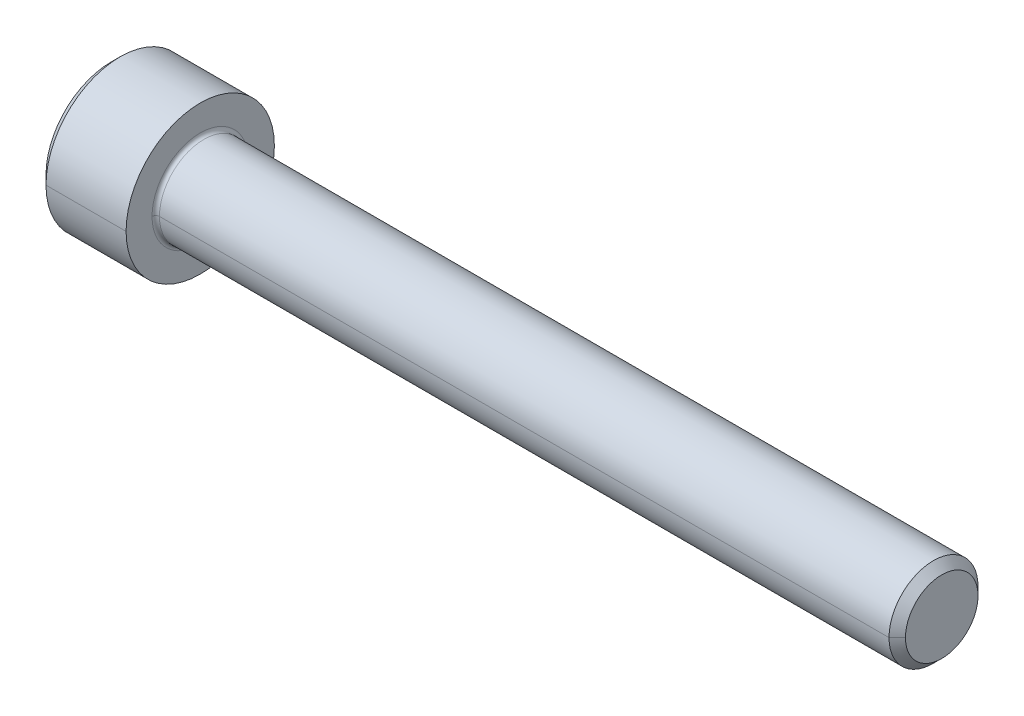
ISO-10303-21;
HEADER;
FILE_DESCRIPTION(('STEP AP214'),'2;1');
FILE_NAME('part.step','',(''),(''),'','','');
FILE_SCHEMA(('AUTOMOTIVE_DESIGN { 1 0 10303 214 1 1 1 1 }'));
ENDSEC;
DATA;
#1=APPLICATION_CONTEXT('core data for automotive mechanical design processes');
#2=APPLICATION_PROTOCOL_DEFINITION('international standard','automotive_design',2000,#1);
#3=PRODUCT_CONTEXT('',#1,'mechanical');
#4=PRODUCT('Part','Part','',(#3));
#5=PRODUCT_RELATED_PRODUCT_CATEGORY('part','',(#4));
#6=PRODUCT_DEFINITION_FORMATION('','',#4);
#7=PRODUCT_DEFINITION_CONTEXT('part definition',#1,'design');
#8=PRODUCT_DEFINITION('design','',#6,#7);
#9=PRODUCT_DEFINITION_SHAPE('','',#8);
#10=(LENGTH_UNIT() NAMED_UNIT(*) SI_UNIT(.MILLI.,.METRE.));
#11=(NAMED_UNIT(*) PLANE_ANGLE_UNIT() SI_UNIT($,.RADIAN.));
#12=(NAMED_UNIT(*) SI_UNIT($,.STERADIAN.) SOLID_ANGLE_UNIT());
#13=UNCERTAINTY_MEASURE_WITH_UNIT(LENGTH_MEASURE(1.E-05),#10,'distance_accuracy_value','');
#14=(GEOMETRIC_REPRESENTATION_CONTEXT(3) GLOBAL_UNCERTAINTY_ASSIGNED_CONTEXT((#13)) GLOBAL_UNIT_ASSIGNED_CONTEXT((#10,
#11,#12)) REPRESENTATION_CONTEXT('',''));
#15=CARTESIAN_POINT('',(0.,0.,0.));
#16=DIRECTION('',(0.,0.,1.));
#17=DIRECTION('',(1.,0.,0.));
#18=AXIS2_PLACEMENT_3D('',#15,#16,#17);
#19=CARTESIAN_POINT('',(3.,0.,0.));
#20=DIRECTION('',(-1.,0.,0.));
#21=DIRECTION('',(0.,0.,1.));
#22=AXIS2_PLACEMENT_3D('',#19,#20,#21);
#23=CONICAL_SURFACE('',#22,2.542,1.0471975511966);
#24=DIRECTION('',(-0.5,0.,-0.866025403784437));
#25=VECTOR('',#24,1.);
#26=CARTESIAN_POINT('',(3.,0.,-2.542));
#27=LINE('',#26,#25);
#28=CARTESIAN_POINT('',(4.46762438428004,0.,0.));
#29=VERTEX_POINT('',#28);
#30=CARTESIAN_POINT('',(3.,0.,-2.542));
#31=VERTEX_POINT('',#30);
#32=EDGE_CURVE('E172',#29,#31,#27,.T.);
#33=ORIENTED_EDGE('',*,*,#32,.F.);
#34=DIRECTION('',(-0.5,0.,0.866025403784437));
#35=VECTOR('',#34,1.);
#36=CARTESIAN_POINT('',(3.,0.,2.542));
#37=LINE('',#36,#35);
#38=CARTESIAN_POINT('',(3.,0.,2.542));
#39=VERTEX_POINT('',#38);
#40=EDGE_CURVE('E175',#29,#39,#37,.T.);
#41=ORIENTED_EDGE('',*,*,#40,.T.);
#42=CARTESIAN_POINT('',(3.,0.,0.));
#43=DIRECTION('',(-1.,0.,0.));
#44=DIRECTION('',(0.,0.,1.));
#45=AXIS2_PLACEMENT_3D('',#42,#43,#44);
#46=CIRCLE('',#45,2.542);
#47=CARTESIAN_POINT('',(3.,2.20143657642004,1.271));
#48=VERTEX_POINT('',#47);
#49=EDGE_CURVE('E193',#39,#48,#46,.T.);
#50=ORIENTED_EDGE('',*,*,#49,.T.);
#51=CARTESIAN_POINT('',(3.,0.,0.));
#52=DIRECTION('',(-1.,0.,0.));
#53=DIRECTION('',(0.,0.,1.));
#54=AXIS2_PLACEMENT_3D('',#51,#52,#53);
#55=CIRCLE('',#54,2.542);
#56=CARTESIAN_POINT('',(3.,2.20143657642004,-1.271));
#57=VERTEX_POINT('',#56);
#58=EDGE_CURVE('E25',#48,#57,#55,.T.);
#59=ORIENTED_EDGE('',*,*,#58,.T.);
#60=CARTESIAN_POINT('',(3.,0.,0.));
#61=DIRECTION('',(-1.,0.,0.));
#62=DIRECTION('',(0.,0.,1.));
#63=AXIS2_PLACEMENT_3D('',#60,#61,#62);
#64=CIRCLE('',#63,2.542);
#65=EDGE_CURVE('E11',#57,#31,#64,.T.);
#66=ORIENTED_EDGE('',*,*,#65,.T.);
#67=EDGE_LOOP('',(#33,#41,#50,#59,#66));
#68=FACE_BOUND('',#67,.T.);
#69=ADVANCED_FACE('F16',(#68),#23,.F.);
#70=CARTESIAN_POINT('',(3.,4.40287315284008,-2.542));
#71=DIRECTION('',(1.,0.,0.));
#72=DIRECTION('',(0.,1.,0.));
#73=AXIS2_PLACEMENT_3D('',#70,#71,#72);
#74=PLANE('',#73);
#75=DIRECTION('',(0.,-0.5,-0.866025403784438));
#76=VECTOR('',#75,1.);
#77=CARTESIAN_POINT('',(3.,2.93524876856006,0.));
#78=LINE('',#77,#76);
#79=CARTESIAN_POINT('',(3.,1.46762438428002,-2.542));
#80=VERTEX_POINT('',#79);
#81=EDGE_CURVE('E43',#57,#80,#78,.T.);
#82=ORIENTED_EDGE('',*,*,#81,.T.);
#83=DIRECTION('',(0.,-1.,0.));
#84=VECTOR('',#83,1.);
#85=CARTESIAN_POINT('',(3.,1.46762438428002,-2.542));
#86=LINE('',#85,#84);
#87=EDGE_CURVE('E365',#80,#31,#86,.T.);
#88=ORIENTED_EDGE('',*,*,#87,.T.);
#89=ORIENTED_EDGE('',*,*,#65,.F.);
#90=EDGE_LOOP('',(#82,#88,#89));
#91=FACE_BOUND('',#90,.T.);
#92=ADVANCED_FACE('F392',(#91),#74,.F.);
#93=CARTESIAN_POINT('',(3.,4.40287315284008,-2.542));
#94=DIRECTION('',(1.,0.,0.));
#95=DIRECTION('',(0.,1.,0.));
#96=AXIS2_PLACEMENT_3D('',#93,#94,#95);
#97=PLANE('',#96);
#98=DIRECTION('',(0.,-0.5,0.866025403784439));
#99=VECTOR('',#98,1.);
#100=CARTESIAN_POINT('',(3.,2.93524876856006,0.));
#101=LINE('',#100,#99);
#102=CARTESIAN_POINT('',(3.,2.93524876856006,0.));
#103=VERTEX_POINT('',#102);
#104=EDGE_CURVE('E219',#103,#48,#101,.T.);
#105=ORIENTED_EDGE('',*,*,#104,.F.);
#106=DIRECTION('',(0.,-0.5,-0.866025403784438));
#107=VECTOR('',#106,1.);
#108=CARTESIAN_POINT('',(3.,2.93524876856006,0.));
#109=LINE('',#108,#107);
#110=EDGE_CURVE('E372',#103,#57,#109,.T.);
#111=ORIENTED_EDGE('',*,*,#110,.T.);
#112=ORIENTED_EDGE('',*,*,#58,.F.);
#113=EDGE_LOOP('',(#105,#111,#112));
#114=FACE_BOUND('',#113,.T.);
#115=ADVANCED_FACE('F18',(#114),#97,.F.);
#116=CARTESIAN_POINT('',(3.,4.40287315284008,-2.542));
#117=DIRECTION('',(1.,0.,0.));
#118=DIRECTION('',(0.,1.,0.));
#119=AXIS2_PLACEMENT_3D('',#116,#117,#118);
#120=PLANE('',#119);
#121=DIRECTION('',(0.,1.,0.));
#122=VECTOR('',#121,1.);
#123=CARTESIAN_POINT('',(3.,-1.46762438428003,2.542));
#124=LINE('',#123,#122);
#125=CARTESIAN_POINT('',(3.,1.46762438428003,2.542));
#126=VERTEX_POINT('',#125);
#127=EDGE_CURVE('E330',#39,#126,#124,.T.);
#128=ORIENTED_EDGE('',*,*,#127,.T.);
#129=DIRECTION('',(0.,-0.5,0.866025403784439));
#130=VECTOR('',#129,1.);
#131=CARTESIAN_POINT('',(3.,2.93524876856006,0.));
#132=LINE('',#131,#130);
#133=EDGE_CURVE('E223',#48,#126,#132,.T.);
#134=ORIENTED_EDGE('',*,*,#133,.F.);
#135=ORIENTED_EDGE('',*,*,#49,.F.);
#136=EDGE_LOOP('',(#128,#134,#135));
#137=FACE_BOUND('',#136,.T.);
#138=ADVANCED_FACE('F384',(#137),#120,.F.);
#139=CARTESIAN_POINT('',(3.,4.40287315284008,-2.542));
#140=DIRECTION('',(1.,0.,0.));
#141=DIRECTION('',(0.,1.,0.));
#142=AXIS2_PLACEMENT_3D('',#139,#140,#141);
#143=PLANE('',#142);
#144=DIRECTION('',(0.,-0.5,-0.866025403784438));
#145=VECTOR('',#144,1.);
#146=CARTESIAN_POINT('',(3.,-1.46762438428003,2.542));
#147=LINE('',#146,#145);
#148=CARTESIAN_POINT('',(3.,-1.46762438428003,2.542));
#149=VERTEX_POINT('',#148);
#150=CARTESIAN_POINT('',(3.,-2.20143657642005,1.271));
#151=VERTEX_POINT('',#150);
#152=EDGE_CURVE('E340',#149,#151,#147,.T.);
#153=ORIENTED_EDGE('',*,*,#152,.F.);
#154=DIRECTION('',(0.,1.,0.));
#155=VECTOR('',#154,1.);
#156=CARTESIAN_POINT('',(3.,-1.46762438428003,2.542));
#157=LINE('',#156,#155);
#158=EDGE_CURVE('E333',#149,#39,#157,.T.);
#159=ORIENTED_EDGE('',*,*,#158,.T.);
#160=CARTESIAN_POINT('',(3.,0.,0.));
#161=DIRECTION('',(-1.,0.,0.));
#162=DIRECTION('',(0.,0.,1.));
#163=AXIS2_PLACEMENT_3D('',#160,#161,#162);
#164=CIRCLE('',#163,2.542);
#165=EDGE_CURVE('E185',#151,#39,#164,.T.);
#166=ORIENTED_EDGE('',*,*,#165,.F.);
#167=EDGE_LOOP('',(#153,#159,#166));
#168=FACE_BOUND('',#167,.T.);
#169=ADVANCED_FACE('F399',(#168),#143,.F.);
#170=CARTESIAN_POINT('',(3.,4.40287315284008,-2.542));
#171=DIRECTION('',(1.,0.,0.));
#172=DIRECTION('',(0.,1.,0.));
#173=AXIS2_PLACEMENT_3D('',#170,#171,#172);
#174=PLANE('',#173);
#175=DIRECTION('',(0.,0.5,-0.866025403784439));
#176=VECTOR('',#175,1.);
#177=CARTESIAN_POINT('',(3.,-2.93524876856007,0.));
#178=LINE('',#177,#176);
#179=CARTESIAN_POINT('',(3.,-2.93524876856007,0.));
#180=VERTEX_POINT('',#179);
#181=CARTESIAN_POINT('',(3.,-2.20143657642005,-1.271));
#182=VERTEX_POINT('',#181);
#183=EDGE_CURVE('E351',#180,#182,#178,.T.);
#184=ORIENTED_EDGE('',*,*,#183,.F.);
#185=DIRECTION('',(0.,-0.5,-0.866025403784438));
#186=VECTOR('',#185,1.);
#187=CARTESIAN_POINT('',(3.,-1.46762438428003,2.542));
#188=LINE('',#187,#186);
#189=EDGE_CURVE('E344',#151,#180,#188,.T.);
#190=ORIENTED_EDGE('',*,*,#189,.F.);
#191=CARTESIAN_POINT('',(3.,0.,0.));
#192=DIRECTION('',(-1.,0.,0.));
#193=DIRECTION('',(0.,0.,1.));
#194=AXIS2_PLACEMENT_3D('',#191,#192,#193);
#195=CIRCLE('',#194,2.542);
#196=EDGE_CURVE('E201',#182,#151,#195,.T.);
#197=ORIENTED_EDGE('',*,*,#196,.F.);
#198=EDGE_LOOP('',(#184,#190,#197));
#199=FACE_BOUND('',#198,.T.);
#200=ADVANCED_FACE('F471',(#199),#174,.F.);
#201=CARTESIAN_POINT('',(3.,4.40287315284008,-2.542));
#202=DIRECTION('',(1.,0.,0.));
#203=DIRECTION('',(0.,1.,0.));
#204=AXIS2_PLACEMENT_3D('',#201,#202,#203);
#205=PLANE('',#204);
#206=DIRECTION('',(0.,-1.,0.));
#207=VECTOR('',#206,1.);
#208=CARTESIAN_POINT('',(3.,1.46762438428002,-2.542));
#209=LINE('',#208,#207);
#210=CARTESIAN_POINT('',(3.,-1.46762438428004,-2.542));
#211=VERTEX_POINT('',#210);
#212=EDGE_CURVE('E362',#31,#211,#209,.T.);
#213=ORIENTED_EDGE('',*,*,#212,.T.);
#214=DIRECTION('',(0.,0.5,-0.866025403784439));
#215=VECTOR('',#214,1.);
#216=CARTESIAN_POINT('',(3.,-2.93524876856007,0.));
#217=LINE('',#216,#215);
#218=EDGE_CURVE('E355',#182,#211,#217,.T.);
#219=ORIENTED_EDGE('',*,*,#218,.F.);
#220=CARTESIAN_POINT('',(3.,0.,0.));
#221=DIRECTION('',(-1.,0.,0.));
#222=DIRECTION('',(0.,0.,1.));
#223=AXIS2_PLACEMENT_3D('',#220,#221,#222);
#224=CIRCLE('',#223,2.542);
#225=EDGE_CURVE('E179',#31,#182,#224,.T.);
#226=ORIENTED_EDGE('',*,*,#225,.F.);
#227=EDGE_LOOP('',(#213,#219,#226));
#228=FACE_BOUND('',#227,.T.);
#229=ADVANCED_FACE('F467',(#228),#205,.F.);
#230=CARTESIAN_POINT('',(3.,2.93524876856006,0.));
#231=DIRECTION('',(0.,0.866025403784438,-0.5));
#232=DIRECTION('',(-1.,0.,0.));
#233=AXIS2_PLACEMENT_3D('',#230,#231,#232);
#234=PLANE('',#233);
#235=DIRECTION('',(0.,-0.5,-0.866025403784438));
#236=VECTOR('',#235,1.);
#237=CARTESIAN_POINT('',(0.,2.93524876856006,0.));
#238=LINE('',#237,#236);
#239=CARTESIAN_POINT('',(0.,2.93524876856006,0.));
#240=VERTEX_POINT('',#239);
#241=CARTESIAN_POINT('',(0.,1.46762438428002,-2.542));
#242=VERTEX_POINT('',#241);
#243=EDGE_CURVE('E301',#240,#242,#238,.T.);
#244=ORIENTED_EDGE('',*,*,#243,.T.);
#245=DIRECTION('',(-1.,0.,0.));
#246=VECTOR('',#245,1.);
#247=CARTESIAN_POINT('',(3.,1.46762438428002,-2.542));
#248=LINE('',#247,#246);
#249=EDGE_CURVE('E368',#80,#242,#248,.T.);
#250=ORIENTED_EDGE('',*,*,#249,.F.);
#251=ORIENTED_EDGE('',*,*,#81,.F.);
#252=ORIENTED_EDGE('',*,*,#110,.F.);
#253=DIRECTION('',(-1.,0.,0.));
#254=VECTOR('',#253,1.);
#255=CARTESIAN_POINT('',(3.,2.93524876856006,0.));
#256=LINE('',#255,#254);
#257=EDGE_CURVE('E224',#103,#240,#256,.T.);
#258=ORIENTED_EDGE('',*,*,#257,.T.);
#259=EDGE_LOOP('',(#244,#250,#251,#252,#258));
#260=FACE_BOUND('',#259,.T.);
#261=ADVANCED_FACE('F429',(#260),#234,.F.);
#262=CARTESIAN_POINT('',(3.,1.46762438428002,-2.542));
#263=DIRECTION('',(0.,0.,-1.));
#264=DIRECTION('',(0.,-1.,0.));
#265=AXIS2_PLACEMENT_3D('',#262,#263,#264);
#266=PLANE('',#265);
#267=DIRECTION('',(0.,-1.,0.));
#268=VECTOR('',#267,1.);
#269=CARTESIAN_POINT('',(0.,1.46762438428002,-2.542));
#270=LINE('',#269,#268);
#271=CARTESIAN_POINT('',(0.,-1.46762438428004,-2.542));
#272=VERTEX_POINT('',#271);
#273=EDGE_CURVE('E305',#242,#272,#270,.T.);
#274=ORIENTED_EDGE('',*,*,#273,.T.);
#275=DIRECTION('',(-1.,0.,0.));
#276=VECTOR('',#275,1.);
#277=CARTESIAN_POINT('',(3.,-1.46762438428004,-2.542));
#278=LINE('',#277,#276);
#279=EDGE_CURVE('E359',#211,#272,#278,.T.);
#280=ORIENTED_EDGE('',*,*,#279,.F.);
#281=ORIENTED_EDGE('',*,*,#212,.F.);
#282=ORIENTED_EDGE('',*,*,#87,.F.);
#283=ORIENTED_EDGE('',*,*,#249,.T.);
#284=EDGE_LOOP('',(#274,#280,#281,#282,#283));
#285=FACE_BOUND('',#284,.T.);
#286=ADVANCED_FACE('F425',(#285),#266,.F.);
#287=CARTESIAN_POINT('',(3.,-2.93524876856007,0.));
#288=DIRECTION('',(0.,0.866025403784439,0.5));
#289=DIRECTION('',(1.,0.,0.));
#290=AXIS2_PLACEMENT_3D('',#287,#288,#289);
#291=PLANE('',#290);
#292=DIRECTION('',(0.,0.5,-0.866025403784439));
#293=VECTOR('',#292,1.);
#294=CARTESIAN_POINT('',(0.,-2.93524876856007,0.));
#295=LINE('',#294,#293);
#296=CARTESIAN_POINT('',(0.,-2.93524876856007,0.));
#297=VERTEX_POINT('',#296);
#298=EDGE_CURVE('E300',#297,#272,#295,.T.);
#299=ORIENTED_EDGE('',*,*,#298,.F.);
#300=DIRECTION('',(-1.,0.,0.));
#301=VECTOR('',#300,1.);
#302=CARTESIAN_POINT('',(3.,-2.93524876856007,0.));
#303=LINE('',#302,#301);
#304=EDGE_CURVE('E348',#180,#297,#303,.T.);
#305=ORIENTED_EDGE('',*,*,#304,.F.);
#306=ORIENTED_EDGE('',*,*,#183,.T.);
#307=ORIENTED_EDGE('',*,*,#218,.T.);
#308=ORIENTED_EDGE('',*,*,#279,.T.);
#309=EDGE_LOOP('',(#299,#305,#306,#307,#308));
#310=FACE_BOUND('',#309,.T.);
#311=ADVANCED_FACE('F428',(#310),#291,.T.);
#312=CARTESIAN_POINT('',(3.,-1.46762438428003,2.542));
#313=DIRECTION('',(0.,0.866025403784438,-0.5));
#314=DIRECTION('',(-1.,0.,0.));
#315=AXIS2_PLACEMENT_3D('',#312,#313,#314);
#316=PLANE('',#315);
#317=DIRECTION('',(0.,-0.5,-0.866025403784438));
#318=VECTOR('',#317,1.);
#319=CARTESIAN_POINT('',(0.,-1.46762438428003,2.542));
#320=LINE('',#319,#318);
#321=CARTESIAN_POINT('',(0.,-1.46762438428003,2.542));
#322=VERTEX_POINT('',#321);
#323=EDGE_CURVE('E255',#322,#297,#320,.T.);
#324=ORIENTED_EDGE('',*,*,#323,.F.);
#325=DIRECTION('',(-1.,0.,0.));
#326=VECTOR('',#325,1.);
#327=CARTESIAN_POINT('',(3.,-1.46762438428003,2.542));
#328=LINE('',#327,#326);
#329=EDGE_CURVE('E337',#149,#322,#328,.T.);
#330=ORIENTED_EDGE('',*,*,#329,.F.);
#331=ORIENTED_EDGE('',*,*,#152,.T.);
#332=ORIENTED_EDGE('',*,*,#189,.T.);
#333=ORIENTED_EDGE('',*,*,#304,.T.);
#334=EDGE_LOOP('',(#324,#330,#331,#332,#333));
#335=FACE_BOUND('',#334,.T.);
#336=ADVANCED_FACE('F434',(#335),#316,.T.);
#337=CARTESIAN_POINT('',(3.,-1.46762438428003,2.542));
#338=DIRECTION('',(0.,0.,1.));
#339=DIRECTION('',(0.,-1.,0.));
#340=AXIS2_PLACEMENT_3D('',#337,#338,#339);
#341=PLANE('',#340);
#342=DIRECTION('',(0.,1.,0.));
#343=VECTOR('',#342,1.);
#344=CARTESIAN_POINT('',(0.,-1.46762438428003,2.542));
#345=LINE('',#344,#343);
#346=CARTESIAN_POINT('',(0.,1.46762438428003,2.542));
#347=VERTEX_POINT('',#346);
#348=EDGE_CURVE('E251',#322,#347,#345,.T.);
#349=ORIENTED_EDGE('',*,*,#348,.T.);
#350=DIRECTION('',(-1.,0.,0.));
#351=VECTOR('',#350,1.);
#352=CARTESIAN_POINT('',(3.,1.46762438428003,2.542));
#353=LINE('',#352,#351);
#354=EDGE_CURVE('E320',#126,#347,#353,.T.);
#355=ORIENTED_EDGE('',*,*,#354,.F.);
#356=ORIENTED_EDGE('',*,*,#127,.F.);
#357=ORIENTED_EDGE('',*,*,#158,.F.);
#358=ORIENTED_EDGE('',*,*,#329,.T.);
#359=EDGE_LOOP('',(#349,#355,#356,#357,#358));
#360=FACE_BOUND('',#359,.T.);
#361=ADVANCED_FACE('F431',(#360),#341,.F.);
#362=CARTESIAN_POINT('',(3.,2.93524876856006,0.));
#363=DIRECTION('',(0.,-0.866025403784439,-0.5));
#364=DIRECTION('',(0.,0.5,-0.866025403784439));
#365=AXIS2_PLACEMENT_3D('',#362,#363,#364);
#366=PLANE('',#365);
#367=DIRECTION('',(0.,-0.5,0.866025403784439));
#368=VECTOR('',#367,1.);
#369=CARTESIAN_POINT('',(0.,2.93524876856006,0.));
#370=LINE('',#369,#368);
#371=EDGE_CURVE('E256',#240,#347,#370,.T.);
#372=ORIENTED_EDGE('',*,*,#371,.F.);
#373=ORIENTED_EDGE('',*,*,#257,.F.);
#374=ORIENTED_EDGE('',*,*,#104,.T.);
#375=ORIENTED_EDGE('',*,*,#133,.T.);
#376=ORIENTED_EDGE('',*,*,#354,.T.);
#377=EDGE_LOOP('',(#372,#373,#374,#375,#376));
#378=FACE_BOUND('',#377,.T.);
#379=ADVANCED_FACE('F390',(#378),#366,.T.);
#380=CARTESIAN_POINT('',(6.25,0.,0.));
#381=DIRECTION('',(1.,0.,0.));
#382=DIRECTION('',(0.,0.,-1.));
#383=AXIS2_PLACEMENT_3D('',#380,#381,#382);
#384=TOROIDAL_SURFACE('',#383,3.24999999999979,0.25);
#385=CARTESIAN_POINT('',(6.25,0.,3.24999999999979));
#386=DIRECTION('',(0.,1.,0.));
#387=DIRECTION('',(0.,0.,1.));
#388=AXIS2_PLACEMENT_3D('',#385,#386,#387);
#389=CIRCLE('',#388,0.25);
#390=CARTESIAN_POINT('',(6.25,0.,2.99999999999979));
#391=VERTEX_POINT('',#390);
#392=CARTESIAN_POINT('',(6.,0.,3.24999999999979));
#393=VERTEX_POINT('',#392);
#394=EDGE_CURVE('E200',#391,#393,#389,.T.);
#395=ORIENTED_EDGE('',*,*,#394,.F.);
#396=CARTESIAN_POINT('',(6.25,0.,0.));
#397=DIRECTION('',(1.,0.,0.));
#398=DIRECTION('',(0.,0.,-1.));
#399=AXIS2_PLACEMENT_3D('',#396,#397,#398);
#400=CIRCLE('',#399,2.99999999999979);
#401=CARTESIAN_POINT('',(6.25,0.,-2.99999999999979));
#402=VERTEX_POINT('',#401);
#403=EDGE_CURVE('E272',#402,#391,#400,.T.);
#404=ORIENTED_EDGE('',*,*,#403,.F.);
#405=CARTESIAN_POINT('',(6.25,0.,-3.24999999999979));
#406=DIRECTION('',(0.,-1.,0.));
#407=DIRECTION('',(0.,0.,-1.));
#408=AXIS2_PLACEMENT_3D('',#405,#406,#407);
#409=CIRCLE('',#408,0.25);
#410=CARTESIAN_POINT('',(6.,0.,-3.24999999999979));
#411=VERTEX_POINT('',#410);
#412=EDGE_CURVE('E236',#402,#411,#409,.T.);
#413=ORIENTED_EDGE('',*,*,#412,.T.);
#414=CARTESIAN_POINT('',(6.,0.,0.));
#415=DIRECTION('',(-1.,0.,0.));
#416=DIRECTION('',(0.,0.,-1.));
#417=AXIS2_PLACEMENT_3D('',#414,#415,#416);
#418=CIRCLE('',#417,3.24999999999979);
#419=EDGE_CURVE('E316',#393,#411,#418,.T.);
#420=ORIENTED_EDGE('',*,*,#419,.F.);
#421=EDGE_LOOP('',(#395,#404,#413,#420));
#422=FACE_BOUND('',#421,.T.);
#423=ADVANCED_FACE('F440',(#422),#384,.F.);
#424=CARTESIAN_POINT('',(0.,0.,0.));
#425=DIRECTION('',(1.,0.,0.));
#426=DIRECTION('',(0.,0.,-1.));
#427=AXIS2_PLACEMENT_3D('',#424,#425,#426);
#428=CONICAL_SURFACE('',#427,4.4,0.785398163397442);
#429=DIRECTION('',(0.707106781186552,0.,0.707106781186543));
#430=VECTOR('',#429,1.);
#431=CARTESIAN_POINT('',(0.,0.,4.4));
#432=LINE('',#431,#430);
#433=CARTESIAN_POINT('',(0.,0.,4.4));
#434=VERTEX_POINT('',#433);
#435=CARTESIAN_POINT('',(0.6,0.,5.));
#436=VERTEX_POINT('',#435);
#437=EDGE_CURVE('E209',#434,#436,#432,.T.);
#438=ORIENTED_EDGE('',*,*,#437,.F.);
#439=CARTESIAN_POINT('',(0.,0.,0.));
#440=DIRECTION('',(-1.,0.,0.));
#441=DIRECTION('',(0.,0.,1.));
#442=AXIS2_PLACEMENT_3D('',#439,#440,#441);
#443=CIRCLE('',#442,4.4);
#444=CARTESIAN_POINT('',(0.,0.,-4.4));
#445=VERTEX_POINT('',#444);
#446=EDGE_CURVE('E276',#445,#434,#443,.T.);
#447=ORIENTED_EDGE('',*,*,#446,.F.);
#448=DIRECTION('',(0.707106781186552,0.,-0.707106781186543));
#449=VECTOR('',#448,1.);
#450=CARTESIAN_POINT('',(0.,0.,-4.4));
#451=LINE('',#450,#449);
#452=CARTESIAN_POINT('',(0.6,0.,-5.));
#453=VERTEX_POINT('',#452);
#454=EDGE_CURVE('E208',#445,#453,#451,.T.);
#455=ORIENTED_EDGE('',*,*,#454,.T.);
#456=CARTESIAN_POINT('',(0.6,0.,0.));
#457=DIRECTION('',(-1.,0.,0.));
#458=DIRECTION('',(0.,0.,1.));
#459=AXIS2_PLACEMENT_3D('',#456,#457,#458);
#460=CIRCLE('',#459,5.);
#461=EDGE_CURVE('E323',#453,#436,#460,.T.);
#462=ORIENTED_EDGE('',*,*,#461,.T.);
#463=EDGE_LOOP('',(#438,#447,#455,#462));
#464=FACE_BOUND('',#463,.T.);
#465=ADVANCED_FACE('F436',(#464),#428,.T.);
#466=CARTESIAN_POINT('',(-31.75,0.,0.));
#467=DIRECTION('',(-1.,0.,0.));
#468=DIRECTION('',(0.,0.,1.));
#469=AXIS2_PLACEMENT_3D('',#466,#467,#468);
#470=CYLINDRICAL_SURFACE('',#469,5.);
#471=DIRECTION('',(-1.,0.,0.));
#472=VECTOR('',#471,1.);
#473=CARTESIAN_POINT('',(-31.75,0.,-5.));
#474=LINE('',#473,#472);
#475=CARTESIAN_POINT('',(6.,0.,-5.));
#476=VERTEX_POINT('',#475);
#477=EDGE_CURVE('E250',#476,#453,#474,.T.);
#478=ORIENTED_EDGE('',*,*,#477,.F.);
#479=CARTESIAN_POINT('',(6.,0.,0.));
#480=DIRECTION('',(-1.,0.,0.));
#481=DIRECTION('',(0.,0.,1.));
#482=AXIS2_PLACEMENT_3D('',#479,#480,#481);
#483=CIRCLE('',#482,5.);
#484=CARTESIAN_POINT('',(6.,0.,5.));
#485=VERTEX_POINT('',#484);
#486=EDGE_CURVE('E213',#476,#485,#483,.T.);
#487=ORIENTED_EDGE('',*,*,#486,.T.);
#488=DIRECTION('',(-1.,0.,0.));
#489=VECTOR('',#488,1.);
#490=CARTESIAN_POINT('',(-31.75,0.,5.));
#491=LINE('',#490,#489);
#492=EDGE_CURVE('E260',#485,#436,#491,.T.);
#493=ORIENTED_EDGE('',*,*,#492,.T.);
#494=ORIENTED_EDGE('',*,*,#461,.F.);
#495=EDGE_LOOP('',(#478,#487,#493,#494));
#496=FACE_BOUND('',#495,.T.);
#497=ADVANCED_FACE('F439',(#496),#470,.T.);
#498=CARTESIAN_POINT('',(6.,5.,0.));
#499=DIRECTION('',(1.,0.,0.));
#500=DIRECTION('',(0.,1.,0.));
#501=AXIS2_PLACEMENT_3D('',#498,#499,#500);
#502=PLANE('',#501);
#503=CARTESIAN_POINT('',(6.,0.,0.));
#504=DIRECTION('',(-1.,0.,0.));
#505=DIRECTION('',(0.,0.,-1.));
#506=AXIS2_PLACEMENT_3D('',#503,#504,#505);
#507=CIRCLE('',#506,3.24999999999979);
#508=EDGE_CURVE('E232',#411,#393,#507,.T.);
#509=ORIENTED_EDGE('',*,*,#508,.T.);
#510=ORIENTED_EDGE('',*,*,#419,.T.);
#511=EDGE_LOOP('',(#509,#510));
#512=FACE_BOUND('',#511,.T.);
#513=CARTESIAN_POINT('',(6.,0.,0.));
#514=DIRECTION('',(-1.,0.,0.));
#515=DIRECTION('',(0.,0.,1.));
#516=AXIS2_PLACEMENT_3D('',#513,#514,#515);
#517=CIRCLE('',#516,5.);
#518=EDGE_CURVE('E246',#485,#476,#517,.T.);
#519=ORIENTED_EDGE('',*,*,#518,.F.);
#520=ORIENTED_EDGE('',*,*,#486,.F.);
#521=EDGE_LOOP('',(#519,#520));
#522=FACE_BOUND('',#521,.T.);
#523=ADVANCED_FACE('F444',(#512,#522),#502,.T.);
#524=CARTESIAN_POINT('',(-31.75,0.,0.));
#525=DIRECTION('',(-1.,0.,0.));
#526=DIRECTION('',(0.,0.,1.));
#527=AXIS2_PLACEMENT_3D('',#524,#525,#526);
#528=CYLINDRICAL_SURFACE('',#527,2.99999999999979);
#529=DIRECTION('',(-1.,0.,0.));
#530=VECTOR('',#529,1.);
#531=CARTESIAN_POINT('',(-31.75,0.,-2.99999999999979));
#532=LINE('',#531,#530);
#533=CARTESIAN_POINT('',(55.4455,0.,-2.99999999999959));
#534=VERTEX_POINT('',#533);
#535=EDGE_CURVE('E268',#534,#402,#532,.T.);
#536=ORIENTED_EDGE('',*,*,#535,.F.);
#537=CARTESIAN_POINT('',(55.4455,0.,0.));
#538=DIRECTION('',(-1.,0.,0.));
#539=DIRECTION('',(0.,0.,1.));
#540=AXIS2_PLACEMENT_3D('',#537,#538,#539);
#541=CIRCLE('',#540,2.99999999999959);
#542=CARTESIAN_POINT('',(55.4455,0.,2.99999999999959));
#543=VERTEX_POINT('',#542);
#544=EDGE_CURVE('E210',#534,#543,#541,.T.);
#545=ORIENTED_EDGE('',*,*,#544,.T.);
#546=DIRECTION('',(-1.,0.,0.));
#547=VECTOR('',#546,1.);
#548=CARTESIAN_POINT('',(-31.75,0.,2.99999999999979));
#549=LINE('',#548,#547);
#550=EDGE_CURVE('E280',#543,#391,#549,.T.);
#551=ORIENTED_EDGE('',*,*,#550,.T.);
#552=CARTESIAN_POINT('',(6.25,0.,0.));
#553=DIRECTION('',(1.,0.,0.));
#554=DIRECTION('',(0.,0.,-1.));
#555=AXIS2_PLACEMENT_3D('',#552,#553,#554);
#556=CIRCLE('',#555,2.99999999999979);
#557=EDGE_CURVE('E196',#391,#402,#556,.T.);
#558=ORIENTED_EDGE('',*,*,#557,.T.);
#559=EDGE_LOOP('',(#536,#545,#551,#558));
#560=FACE_BOUND('',#559,.T.);
#561=ADVANCED_FACE('F419',(#560),#528,.T.);
#562=CARTESIAN_POINT('',(56.,0.,0.));
#563=DIRECTION('',(-1.,0.,0.));
#564=DIRECTION('',(0.,0.,1.));
#565=AXIS2_PLACEMENT_3D('',#562,#563,#564);
#566=CONICAL_SURFACE('',#565,2.4455,0.785398163396729);
#567=DIRECTION('',(-0.707106781187056,0.,-0.707106781186039));
#568=VECTOR('',#567,1.);
#569=CARTESIAN_POINT('',(56.,0.,-2.4455));
#570=LINE('',#569,#568);
#571=CARTESIAN_POINT('',(56.,0.,-2.4455));
#572=VERTEX_POINT('',#571);
#573=EDGE_CURVE('E287',#572,#534,#570,.T.);
#574=ORIENTED_EDGE('',*,*,#573,.F.);
#575=CARTESIAN_POINT('',(56.,0.,0.));
#576=DIRECTION('',(-1.,0.,0.));
#577=DIRECTION('',(0.,0.,1.));
#578=AXIS2_PLACEMENT_3D('',#575,#576,#577);
#579=CIRCLE('',#578,2.4455);
#580=CARTESIAN_POINT('',(56.,0.,2.4455));
#581=VERTEX_POINT('',#580);
#582=EDGE_CURVE('E214',#572,#581,#579,.T.);
#583=ORIENTED_EDGE('',*,*,#582,.T.);
#584=DIRECTION('',(-0.707106781187056,0.,0.707106781186039));
#585=VECTOR('',#584,1.);
#586=CARTESIAN_POINT('',(56.,0.,2.4455));
#587=LINE('',#586,#585);
#588=EDGE_CURVE('E291',#581,#543,#587,.T.);
#589=ORIENTED_EDGE('',*,*,#588,.T.);
#590=ORIENTED_EDGE('',*,*,#544,.F.);
#591=EDGE_LOOP('',(#574,#583,#589,#590));
#592=FACE_BOUND('',#591,.T.);
#593=ADVANCED_FACE('F416',(#592),#566,.T.);
#594=CARTESIAN_POINT('',(56.,2.4455,0.));
#595=DIRECTION('',(1.,0.,0.));
#596=DIRECTION('',(0.,1.,0.));
#597=AXIS2_PLACEMENT_3D('',#594,#595,#596);
#598=PLANE('',#597);
#599=CARTESIAN_POINT('',(56.,0.,0.));
#600=DIRECTION('',(-1.,0.,0.));
#601=DIRECTION('',(0.,0.,1.));
#602=AXIS2_PLACEMENT_3D('',#599,#600,#601);
#603=CIRCLE('',#602,2.4455);
#604=EDGE_CURVE('E283',#581,#572,#603,.T.);
#605=ORIENTED_EDGE('',*,*,#604,.F.);
#606=ORIENTED_EDGE('',*,*,#582,.F.);
#607=EDGE_LOOP('',(#605,#606));
#608=FACE_BOUND('',#607,.T.);
#609=ADVANCED_FACE('F408',(#608),#598,.T.);
#610=CARTESIAN_POINT('',(0.,0.,0.));
#611=DIRECTION('',(-1.,0.,0.));
#612=DIRECTION('',(0.,0.,1.));
#613=AXIS2_PLACEMENT_3D('',#610,#611,#612);
#614=PLANE('',#613);
#615=ORIENTED_EDGE('',*,*,#371,.T.);
#616=ORIENTED_EDGE('',*,*,#348,.F.);
#617=ORIENTED_EDGE('',*,*,#323,.T.);
#618=ORIENTED_EDGE('',*,*,#298,.T.);
#619=ORIENTED_EDGE('',*,*,#273,.F.);
#620=ORIENTED_EDGE('',*,*,#243,.F.);
#621=EDGE_LOOP('',(#615,#616,#617,#618,#619,#620));
#622=FACE_BOUND('',#621,.T.);
#623=ORIENTED_EDGE('',*,*,#446,.T.);
#624=CARTESIAN_POINT('',(0.,0.,0.));
#625=DIRECTION('',(-1.,0.,0.));
#626=DIRECTION('',(0.,0.,1.));
#627=AXIS2_PLACEMENT_3D('',#624,#625,#626);
#628=CIRCLE('',#627,4.4);
#629=EDGE_CURVE('E218',#434,#445,#628,.T.);
#630=ORIENTED_EDGE('',*,*,#629,.T.);
#631=EDGE_LOOP('',(#623,#630));
#632=FACE_BOUND('',#631,.T.);
#633=ADVANCED_FACE('F448',(#622,#632),#614,.T.);
#634=CARTESIAN_POINT('',(56.,0.,0.));
#635=DIRECTION('',(-1.,0.,0.));
#636=DIRECTION('',(0.,0.,1.));
#637=AXIS2_PLACEMENT_3D('',#634,#635,#636);
#638=CONICAL_SURFACE('',#637,2.4455,0.785398163396729);
#639=ORIENTED_EDGE('',*,*,#604,.T.);
#640=ORIENTED_EDGE('',*,*,#573,.T.);
#641=CARTESIAN_POINT('',(55.4455,0.,0.));
#642=DIRECTION('',(-1.,0.,0.));
#643=DIRECTION('',(0.,0.,1.));
#644=AXIS2_PLACEMENT_3D('',#641,#642,#643);
#645=CIRCLE('',#644,2.99999999999959);
#646=EDGE_CURVE('E264',#543,#534,#645,.T.);
#647=ORIENTED_EDGE('',*,*,#646,.F.);
#648=ORIENTED_EDGE('',*,*,#588,.F.);
#649=EDGE_LOOP('',(#639,#640,#647,#648));
#650=FACE_BOUND('',#649,.T.);
#651=ADVANCED_FACE('F423',(#650),#638,.T.);
#652=CARTESIAN_POINT('',(-31.75,0.,0.));
#653=DIRECTION('',(-1.,0.,0.));
#654=DIRECTION('',(0.,0.,1.));
#655=AXIS2_PLACEMENT_3D('',#652,#653,#654);
#656=CYLINDRICAL_SURFACE('',#655,2.99999999999979);
#657=ORIENTED_EDGE('',*,*,#646,.T.);
#658=ORIENTED_EDGE('',*,*,#535,.T.);
#659=ORIENTED_EDGE('',*,*,#403,.T.);
#660=ORIENTED_EDGE('',*,*,#550,.F.);
#661=EDGE_LOOP('',(#657,#658,#659,#660));
#662=FACE_BOUND('',#661,.T.);
#663=ADVANCED_FACE('F414',(#662),#656,.T.);
#664=CARTESIAN_POINT('',(-31.75,0.,0.));
#665=DIRECTION('',(-1.,0.,0.));
#666=DIRECTION('',(0.,0.,1.));
#667=AXIS2_PLACEMENT_3D('',#664,#665,#666);
#668=CYLINDRICAL_SURFACE('',#667,5.);
#669=ORIENTED_EDGE('',*,*,#518,.T.);
#670=ORIENTED_EDGE('',*,*,#477,.T.);
#671=CARTESIAN_POINT('',(0.6,0.,0.));
#672=DIRECTION('',(-1.,0.,0.));
#673=DIRECTION('',(0.,0.,1.));
#674=AXIS2_PLACEMENT_3D('',#671,#672,#673);
#675=CIRCLE('',#674,5.);
#676=EDGE_CURVE('E204',#436,#453,#675,.T.);
#677=ORIENTED_EDGE('',*,*,#676,.F.);
#678=ORIENTED_EDGE('',*,*,#492,.F.);
#679=EDGE_LOOP('',(#669,#670,#677,#678));
#680=FACE_BOUND('',#679,.T.);
#681=ADVANCED_FACE('F410',(#680),#668,.T.);
#682=CARTESIAN_POINT('',(0.,0.,0.));
#683=DIRECTION('',(1.,0.,0.));
#684=DIRECTION('',(0.,0.,-1.));
#685=AXIS2_PLACEMENT_3D('',#682,#683,#684);
#686=CONICAL_SURFACE('',#685,4.4,0.785398163397442);
#687=ORIENTED_EDGE('',*,*,#629,.F.);
#688=ORIENTED_EDGE('',*,*,#437,.T.);
#689=ORIENTED_EDGE('',*,*,#676,.T.);
#690=ORIENTED_EDGE('',*,*,#454,.F.);
#691=EDGE_LOOP('',(#687,#688,#689,#690));
#692=FACE_BOUND('',#691,.T.);
#693=ADVANCED_FACE('F413',(#692),#686,.T.);
#694=CARTESIAN_POINT('',(6.25,0.,0.));
#695=DIRECTION('',(1.,0.,0.));
#696=DIRECTION('',(0.,0.,-1.));
#697=AXIS2_PLACEMENT_3D('',#694,#695,#696);
#698=TOROIDAL_SURFACE('',#697,3.24999999999979,0.25);
#699=ORIENTED_EDGE('',*,*,#557,.F.);
#700=ORIENTED_EDGE('',*,*,#394,.T.);
#701=ORIENTED_EDGE('',*,*,#508,.F.);
#702=ORIENTED_EDGE('',*,*,#412,.F.);
#703=EDGE_LOOP('',(#699,#700,#701,#702));
#704=FACE_BOUND('',#703,.T.);
#705=ADVANCED_FACE('F507',(#704),#698,.F.);
#706=CARTESIAN_POINT('',(3.,0.,0.));
#707=DIRECTION('',(-1.,0.,0.));
#708=DIRECTION('',(0.,0.,1.));
#709=AXIS2_PLACEMENT_3D('',#706,#707,#708);
#710=CONICAL_SURFACE('',#709,2.542,1.0471975511966);
#711=ORIENTED_EDGE('',*,*,#40,.F.);
#712=ORIENTED_EDGE('',*,*,#32,.T.);
#713=ORIENTED_EDGE('',*,*,#225,.T.);
#714=ORIENTED_EDGE('',*,*,#196,.T.);
#715=ORIENTED_EDGE('',*,*,#165,.T.);
#716=EDGE_LOOP('',(#711,#712,#713,#714,#715));
#717=FACE_BOUND('',#716,.T.);
#718=ADVANCED_FACE('F182',(#717),#710,.F.);
#719=CLOSED_SHELL('',(#69,#92,#115,#138,#169,#200,#229,#261,#286,#311,#336,#361,#379,#423,#465,
#497,#523,#561,#593,#609,#633,#651,#663,#681,#693,#705,#718));
#720=MANIFOLD_SOLID_BREP('B1',#719);
#721=ADVANCED_BREP_SHAPE_REPRESENTATION('',(#18,#720),#14);
#722=SHAPE_DEFINITION_REPRESENTATION(#9,#721);
ENDSEC;
END-ISO-10303-21;
